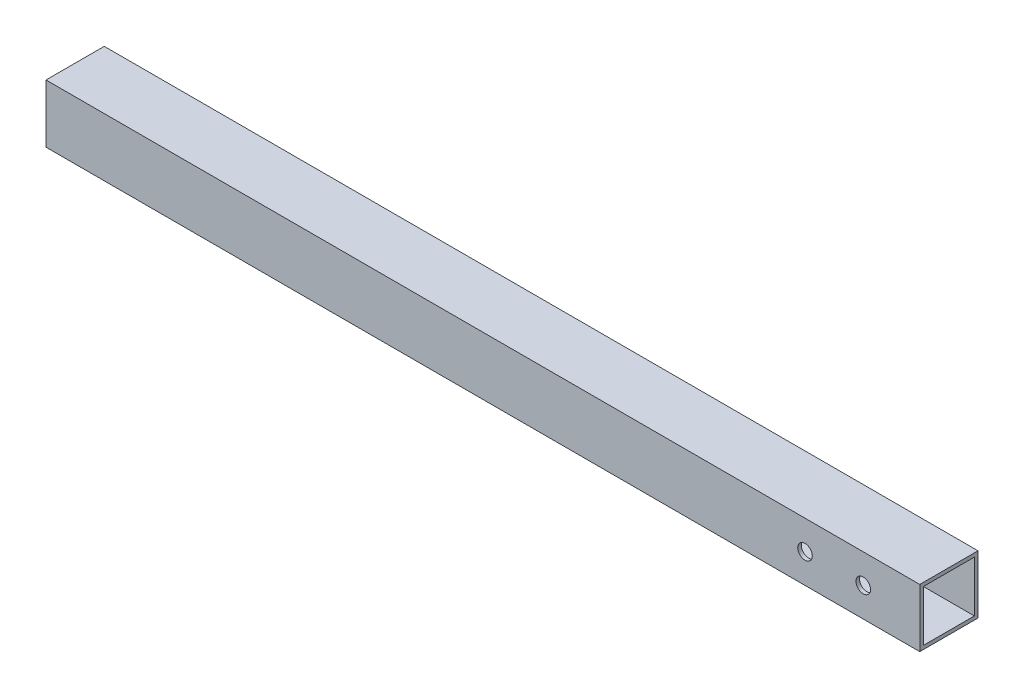
ISO-10303-21;
HEADER;
FILE_DESCRIPTION(('STEP AP214'),'2;1');
FILE_NAME('part.step','',(''),(''),'','','');
FILE_SCHEMA(('AUTOMOTIVE_DESIGN { 1 0 10303 214 1 1 1 1 }'));
ENDSEC;
DATA;
#1=APPLICATION_CONTEXT('core data for automotive mechanical design processes');
#2=APPLICATION_PROTOCOL_DEFINITION('international standard','automotive_design',2000,#1);
#3=PRODUCT_CONTEXT('',#1,'mechanical');
#4=PRODUCT('Part','Part','',(#3));
#5=PRODUCT_RELATED_PRODUCT_CATEGORY('part','',(#4));
#6=PRODUCT_DEFINITION_FORMATION('','',#4);
#7=PRODUCT_DEFINITION_CONTEXT('part definition',#1,'design');
#8=PRODUCT_DEFINITION('design','',#6,#7);
#9=PRODUCT_DEFINITION_SHAPE('','',#8);
#10=(LENGTH_UNIT() NAMED_UNIT(*) SI_UNIT(.MILLI.,.METRE.));
#11=(NAMED_UNIT(*) PLANE_ANGLE_UNIT() SI_UNIT($,.RADIAN.));
#12=(NAMED_UNIT(*) SI_UNIT($,.STERADIAN.) SOLID_ANGLE_UNIT());
#13=UNCERTAINTY_MEASURE_WITH_UNIT(LENGTH_MEASURE(1.E-05),#10,'distance_accuracy_value','');
#14=(GEOMETRIC_REPRESENTATION_CONTEXT(3) GLOBAL_UNCERTAINTY_ASSIGNED_CONTEXT((#13)) GLOBAL_UNIT_ASSIGNED_CONTEXT((#10,
#11,#12)) REPRESENTATION_CONTEXT('',''));
#15=CARTESIAN_POINT('',(0.,0.,0.));
#16=DIRECTION('',(0.,0.,1.));
#17=DIRECTION('',(1.,0.,0.));
#18=AXIS2_PLACEMENT_3D('',#15,#16,#17);
#19=CARTESIAN_POINT('',(381.,0.,0.));
#20=DIRECTION('',(1.,0.,0.));
#21=DIRECTION('',(0.,0.,-1.));
#22=AXIS2_PLACEMENT_3D('',#19,#20,#21);
#23=PLANE('',#22);
#24=DIRECTION('',(0.,1.,0.));
#25=VECTOR('',#24,1.);
#26=CARTESIAN_POINT('',(381.,12.7,-12.7));
#27=LINE('',#26,#25);
#28=CARTESIAN_POINT('',(381.,-12.7,-12.7));
#29=VERTEX_POINT('',#28);
#30=CARTESIAN_POINT('',(381.,12.7,-12.7));
#31=VERTEX_POINT('',#30);
#32=EDGE_CURVE('E139',#29,#31,#27,.T.);
#33=ORIENTED_EDGE('',*,*,#32,.T.);
#34=DIRECTION('',(0.,0.,1.));
#35=VECTOR('',#34,1.);
#36=CARTESIAN_POINT('',(381.,12.7,12.7));
#37=LINE('',#36,#35);
#38=CARTESIAN_POINT('',(381.,12.7,12.7));
#39=VERTEX_POINT('',#38);
#40=EDGE_CURVE('E142',#31,#39,#37,.T.);
#41=ORIENTED_EDGE('',*,*,#40,.T.);
#42=DIRECTION('',(0.,-1.,0.));
#43=VECTOR('',#42,1.);
#44=CARTESIAN_POINT('',(381.,12.7,12.7));
#45=LINE('',#44,#43);
#46=CARTESIAN_POINT('',(381.,-12.7,12.7));
#47=VERTEX_POINT('',#46);
#48=EDGE_CURVE('E145',#39,#47,#45,.T.);
#49=ORIENTED_EDGE('',*,*,#48,.T.);
#50=DIRECTION('',(0.,0.,-1.));
#51=VECTOR('',#50,1.);
#52=CARTESIAN_POINT('',(381.,-12.7,12.7));
#53=LINE('',#52,#51);
#54=EDGE_CURVE('E147',#47,#29,#53,.T.);
#55=ORIENTED_EDGE('',*,*,#54,.T.);
#56=EDGE_LOOP('',(#33,#41,#49,#55));
#57=FACE_BOUND('',#56,.T.);
#58=DIRECTION('',(0.,-1.,0.));
#59=VECTOR('',#58,1.);
#60=CARTESIAN_POINT('',(381.,11.1125,11.1125));
#61=LINE('',#60,#59);
#62=CARTESIAN_POINT('',(381.,11.1125,11.1125));
#63=VERTEX_POINT('',#62);
#64=CARTESIAN_POINT('',(381.,-11.1125,11.1125));
#65=VERTEX_POINT('',#64);
#66=EDGE_CURVE('E109',#63,#65,#61,.T.);
#67=ORIENTED_EDGE('',*,*,#66,.F.);
#68=DIRECTION('',(0.,0.,1.));
#69=VECTOR('',#68,1.);
#70=CARTESIAN_POINT('',(381.,11.1125,11.1125));
#71=LINE('',#70,#69);
#72=CARTESIAN_POINT('',(381.,11.1125,-11.1125));
#73=VERTEX_POINT('',#72);
#74=EDGE_CURVE('E101',#73,#63,#71,.T.);
#75=ORIENTED_EDGE('',*,*,#74,.F.);
#76=DIRECTION('',(0.,1.,0.));
#77=VECTOR('',#76,1.);
#78=CARTESIAN_POINT('',(381.,11.1125,-11.1125));
#79=LINE('',#78,#77);
#80=CARTESIAN_POINT('',(381.,-11.1125,-11.1125));
#81=VERTEX_POINT('',#80);
#82=EDGE_CURVE('E123',#81,#73,#79,.T.);
#83=ORIENTED_EDGE('',*,*,#82,.F.);
#84=DIRECTION('',(0.,0.,-1.));
#85=VECTOR('',#84,1.);
#86=CARTESIAN_POINT('',(381.,-11.1125,11.1125));
#87=LINE('',#86,#85);
#88=EDGE_CURVE('E121',#65,#81,#87,.T.);
#89=ORIENTED_EDGE('',*,*,#88,.F.);
#90=EDGE_LOOP('',(#67,#75,#83,#89));
#91=FACE_BOUND('',#90,.T.);
#92=ADVANCED_FACE('F34',(#57,#91),#23,.T.);
#93=CARTESIAN_POINT('',(0.,0.,0.));
#94=DIRECTION('',(1.,0.,0.));
#95=DIRECTION('',(0.,0.,-1.));
#96=AXIS2_PLACEMENT_3D('',#93,#94,#95);
#97=PLANE('',#96);
#98=DIRECTION('',(0.,1.,0.));
#99=VECTOR('',#98,1.);
#100=CARTESIAN_POINT('',(0.,12.7,-12.7));
#101=LINE('',#100,#99);
#102=CARTESIAN_POINT('',(0.,-12.7,-12.7));
#103=VERTEX_POINT('',#102);
#104=CARTESIAN_POINT('',(0.,12.7,-12.7));
#105=VERTEX_POINT('',#104);
#106=EDGE_CURVE('E117',#103,#105,#101,.T.);
#107=ORIENTED_EDGE('',*,*,#106,.F.);
#108=DIRECTION('',(0.,0.,-1.));
#109=VECTOR('',#108,1.);
#110=CARTESIAN_POINT('',(0.,-12.7,12.7));
#111=LINE('',#110,#109);
#112=CARTESIAN_POINT('',(0.,-12.7,12.7));
#113=VERTEX_POINT('',#112);
#114=EDGE_CURVE('E143',#113,#103,#111,.T.);
#115=ORIENTED_EDGE('',*,*,#114,.F.);
#116=DIRECTION('',(0.,-1.,0.));
#117=VECTOR('',#116,1.);
#118=CARTESIAN_POINT('',(0.,12.7,12.7));
#119=LINE('',#118,#117);
#120=CARTESIAN_POINT('',(0.,12.7,12.7));
#121=VERTEX_POINT('',#120);
#122=EDGE_CURVE('E154',#121,#113,#119,.T.);
#123=ORIENTED_EDGE('',*,*,#122,.F.);
#124=DIRECTION('',(0.,0.,1.));
#125=VECTOR('',#124,1.);
#126=CARTESIAN_POINT('',(0.,12.7,12.7));
#127=LINE('',#126,#125);
#128=EDGE_CURVE('E152',#105,#121,#127,.T.);
#129=ORIENTED_EDGE('',*,*,#128,.F.);
#130=EDGE_LOOP('',(#107,#115,#123,#129));
#131=FACE_BOUND('',#130,.T.);
#132=DIRECTION('',(0.,0.,1.));
#133=VECTOR('',#132,1.);
#134=CARTESIAN_POINT('',(0.,11.1125,11.1125));
#135=LINE('',#134,#133);
#136=CARTESIAN_POINT('',(0.,11.1125,-11.1125));
#137=VERTEX_POINT('',#136);
#138=CARTESIAN_POINT('',(0.,11.1125,11.1125));
#139=VERTEX_POINT('',#138);
#140=EDGE_CURVE('E59',#137,#139,#135,.T.);
#141=ORIENTED_EDGE('',*,*,#140,.T.);
#142=DIRECTION('',(0.,-1.,0.));
#143=VECTOR('',#142,1.);
#144=CARTESIAN_POINT('',(0.,11.1125,11.1125));
#145=LINE('',#144,#143);
#146=CARTESIAN_POINT('',(0.,-11.1125,11.1125));
#147=VERTEX_POINT('',#146);
#148=EDGE_CURVE('E116',#139,#147,#145,.T.);
#149=ORIENTED_EDGE('',*,*,#148,.T.);
#150=DIRECTION('',(0.,0.,-1.));
#151=VECTOR('',#150,1.);
#152=CARTESIAN_POINT('',(0.,-11.1125,11.1125));
#153=LINE('',#152,#151);
#154=CARTESIAN_POINT('',(0.,-11.1125,-11.1125));
#155=VERTEX_POINT('',#154);
#156=EDGE_CURVE('E131',#147,#155,#153,.T.);
#157=ORIENTED_EDGE('',*,*,#156,.T.);
#158=DIRECTION('',(0.,1.,0.));
#159=VECTOR('',#158,1.);
#160=CARTESIAN_POINT('',(0.,11.1125,-11.1125));
#161=LINE('',#160,#159);
#162=EDGE_CURVE('E110',#155,#137,#161,.T.);
#163=ORIENTED_EDGE('',*,*,#162,.T.);
#164=EDGE_LOOP('',(#141,#149,#157,#163));
#165=FACE_BOUND('',#164,.T.);
#166=ADVANCED_FACE('F202',(#131,#165),#97,.F.);
#167=CARTESIAN_POINT('',(381.,12.7,-12.7));
#168=DIRECTION('',(0.,0.,1.));
#169=DIRECTION('',(0.,-1.,0.));
#170=AXIS2_PLACEMENT_3D('',#167,#168,#169);
#171=PLANE('',#170);
#172=CARTESIAN_POINT('',(330.962,0.,-12.7));
#173=DIRECTION('',(0.,0.,-1.));
#174=DIRECTION('',(0.,1.,0.));
#175=AXIS2_PLACEMENT_3D('',#172,#173,#174);
#176=CIRCLE('',#175,3.17499999999997);
#177=CARTESIAN_POINT('',(330.962,3.17499999999997,-12.7));
#178=VERTEX_POINT('',#177);
#179=EDGE_CURVE('E263',#178,#178,#176,.T.);
#180=ORIENTED_EDGE('',*,*,#179,.F.);
#181=EDGE_LOOP('',(#180));
#182=FACE_BOUND('',#181,.T.);
#183=CARTESIAN_POINT('',(356.362,0.,-12.7));
#184=DIRECTION('',(0.,0.,-1.));
#185=DIRECTION('',(0.,1.,0.));
#186=AXIS2_PLACEMENT_3D('',#183,#184,#185);
#187=CIRCLE('',#186,3.17499999999997);
#188=CARTESIAN_POINT('',(356.362,3.17499999999997,-12.7));
#189=VERTEX_POINT('',#188);
#190=EDGE_CURVE('E166',#189,#189,#187,.T.);
#191=ORIENTED_EDGE('',*,*,#190,.F.);
#192=EDGE_LOOP('',(#191));
#193=FACE_BOUND('',#192,.T.);
#194=ORIENTED_EDGE('',*,*,#106,.T.);
#195=DIRECTION('',(-1.,0.,0.));
#196=VECTOR('',#195,1.);
#197=CARTESIAN_POINT('',(381.,12.7,-12.7));
#198=LINE('',#197,#196);
#199=EDGE_CURVE('E11',#31,#105,#198,.T.);
#200=ORIENTED_EDGE('',*,*,#199,.F.);
#201=ORIENTED_EDGE('',*,*,#32,.F.);
#202=DIRECTION('',(-1.,0.,0.));
#203=VECTOR('',#202,1.);
#204=CARTESIAN_POINT('',(381.,-12.7,-12.7));
#205=LINE('',#204,#203);
#206=EDGE_CURVE('E149',#29,#103,#205,.T.);
#207=ORIENTED_EDGE('',*,*,#206,.T.);
#208=EDGE_LOOP('',(#194,#200,#201,#207));
#209=FACE_BOUND('',#208,.T.);
#210=ADVANCED_FACE('F36',(#182,#193,#209),#171,.F.);
#211=CARTESIAN_POINT('',(381.,12.7,12.7));
#212=DIRECTION('',(0.,-1.,0.));
#213=DIRECTION('',(0.,0.,-1.));
#214=AXIS2_PLACEMENT_3D('',#211,#212,#213);
#215=PLANE('',#214);
#216=ORIENTED_EDGE('',*,*,#128,.T.);
#217=DIRECTION('',(-1.,0.,0.));
#218=VECTOR('',#217,1.);
#219=CARTESIAN_POINT('',(381.,12.7,12.7));
#220=LINE('',#219,#218);
#221=EDGE_CURVE('E43',#39,#121,#220,.T.);
#222=ORIENTED_EDGE('',*,*,#221,.F.);
#223=ORIENTED_EDGE('',*,*,#40,.F.);
#224=ORIENTED_EDGE('',*,*,#199,.T.);
#225=EDGE_LOOP('',(#216,#222,#223,#224));
#226=FACE_BOUND('',#225,.T.);
#227=ADVANCED_FACE('F218',(#226),#215,.F.);
#228=CARTESIAN_POINT('',(381.,12.7,12.7));
#229=DIRECTION('',(0.,0.,-1.));
#230=DIRECTION('',(0.,1.,0.));
#231=AXIS2_PLACEMENT_3D('',#228,#229,#230);
#232=PLANE('',#231);
#233=CARTESIAN_POINT('',(330.962,0.,12.7));
#234=DIRECTION('',(0.,0.,-1.));
#235=DIRECTION('',(0.,1.,0.));
#236=AXIS2_PLACEMENT_3D('',#233,#234,#235);
#237=CIRCLE('',#236,3.17499999999997);
#238=CARTESIAN_POINT('',(330.962,3.17499999999997,12.7));
#239=VERTEX_POINT('',#238);
#240=EDGE_CURVE('E172',#239,#239,#237,.T.);
#241=ORIENTED_EDGE('',*,*,#240,.T.);
#242=EDGE_LOOP('',(#241));
#243=FACE_BOUND('',#242,.T.);
#244=CARTESIAN_POINT('',(356.362,0.,12.7));
#245=DIRECTION('',(0.,0.,-1.));
#246=DIRECTION('',(0.,1.,0.));
#247=AXIS2_PLACEMENT_3D('',#244,#245,#246);
#248=CIRCLE('',#247,3.17499999999997);
#249=CARTESIAN_POINT('',(356.362,3.17499999999997,12.7));
#250=VERTEX_POINT('',#249);
#251=EDGE_CURVE('E129',#250,#250,#248,.T.);
#252=ORIENTED_EDGE('',*,*,#251,.T.);
#253=EDGE_LOOP('',(#252));
#254=FACE_BOUND('',#253,.T.);
#255=ORIENTED_EDGE('',*,*,#122,.T.);
#256=DIRECTION('',(-1.,0.,0.));
#257=VECTOR('',#256,1.);
#258=CARTESIAN_POINT('',(381.,-12.7,12.7));
#259=LINE('',#258,#257);
#260=EDGE_CURVE('E159',#47,#113,#259,.T.);
#261=ORIENTED_EDGE('',*,*,#260,.F.);
#262=ORIENTED_EDGE('',*,*,#48,.F.);
#263=ORIENTED_EDGE('',*,*,#221,.T.);
#264=EDGE_LOOP('',(#255,#261,#262,#263));
#265=FACE_BOUND('',#264,.T.);
#266=ADVANCED_FACE('F183',(#243,#254,#265),#232,.F.);
#267=CARTESIAN_POINT('',(381.,-12.7,12.7));
#268=DIRECTION('',(0.,1.,0.));
#269=DIRECTION('',(0.,0.,1.));
#270=AXIS2_PLACEMENT_3D('',#267,#268,#269);
#271=PLANE('',#270);
#272=ORIENTED_EDGE('',*,*,#114,.T.);
#273=ORIENTED_EDGE('',*,*,#206,.F.);
#274=ORIENTED_EDGE('',*,*,#54,.F.);
#275=ORIENTED_EDGE('',*,*,#260,.T.);
#276=EDGE_LOOP('',(#272,#273,#274,#275));
#277=FACE_BOUND('',#276,.T.);
#278=ADVANCED_FACE('F213',(#277),#271,.F.);
#279=CARTESIAN_POINT('',(381.,11.1125,11.1125));
#280=DIRECTION('',(0.,-1.,0.));
#281=DIRECTION('',(0.,0.,-1.));
#282=AXIS2_PLACEMENT_3D('',#279,#280,#281);
#283=PLANE('',#282);
#284=ORIENTED_EDGE('',*,*,#140,.F.);
#285=DIRECTION('',(-1.,0.,0.));
#286=VECTOR('',#285,1.);
#287=CARTESIAN_POINT('',(381.,11.1125,-11.1125));
#288=LINE('',#287,#286);
#289=EDGE_CURVE('E105',#73,#137,#288,.T.);
#290=ORIENTED_EDGE('',*,*,#289,.F.);
#291=ORIENTED_EDGE('',*,*,#74,.T.);
#292=DIRECTION('',(-1.,0.,0.));
#293=VECTOR('',#292,1.);
#294=CARTESIAN_POINT('',(381.,11.1125,11.1125));
#295=LINE('',#294,#293);
#296=EDGE_CURVE('E104',#63,#139,#295,.T.);
#297=ORIENTED_EDGE('',*,*,#296,.T.);
#298=EDGE_LOOP('',(#284,#290,#291,#297));
#299=FACE_BOUND('',#298,.T.);
#300=ADVANCED_FACE('F103',(#299),#283,.T.);
#301=CARTESIAN_POINT('',(381.,11.1125,11.1125));
#302=DIRECTION('',(0.,0.,-1.));
#303=DIRECTION('',(0.,1.,0.));
#304=AXIS2_PLACEMENT_3D('',#301,#302,#303);
#305=PLANE('',#304);
#306=CARTESIAN_POINT('',(330.962,0.,11.1125));
#307=DIRECTION('',(0.,0.,-1.));
#308=DIRECTION('',(0.,1.,0.));
#309=AXIS2_PLACEMENT_3D('',#306,#307,#308);
#310=CIRCLE('',#309,3.17499999999997);
#311=CARTESIAN_POINT('',(330.962,3.17499999999997,11.1125));
#312=VERTEX_POINT('',#311);
#313=EDGE_CURVE('E177',#312,#312,#310,.T.);
#314=ORIENTED_EDGE('',*,*,#313,.F.);
#315=EDGE_LOOP('',(#314));
#316=FACE_BOUND('',#315,.T.);
#317=CARTESIAN_POINT('',(356.362,0.,11.1125));
#318=DIRECTION('',(0.,0.,-1.));
#319=DIRECTION('',(0.,1.,0.));
#320=AXIS2_PLACEMENT_3D('',#317,#318,#319);
#321=CIRCLE('',#320,3.17499999999997);
#322=CARTESIAN_POINT('',(356.362,3.17499999999997,11.1125));
#323=VERTEX_POINT('',#322);
#324=EDGE_CURVE('E165',#323,#323,#321,.T.);
#325=ORIENTED_EDGE('',*,*,#324,.F.);
#326=EDGE_LOOP('',(#325));
#327=FACE_BOUND('',#326,.T.);
#328=ORIENTED_EDGE('',*,*,#148,.F.);
#329=ORIENTED_EDGE('',*,*,#296,.F.);
#330=ORIENTED_EDGE('',*,*,#66,.T.);
#331=DIRECTION('',(-1.,0.,0.));
#332=VECTOR('',#331,1.);
#333=CARTESIAN_POINT('',(381.,-11.1125,11.1125));
#334=LINE('',#333,#332);
#335=EDGE_CURVE('E118',#65,#147,#334,.T.);
#336=ORIENTED_EDGE('',*,*,#335,.T.);
#337=EDGE_LOOP('',(#328,#329,#330,#336));
#338=FACE_BOUND('',#337,.T.);
#339=ADVANCED_FACE('F113',(#316,#327,#338),#305,.T.);
#340=CARTESIAN_POINT('',(381.,-11.1125,11.1125));
#341=DIRECTION('',(0.,1.,0.));
#342=DIRECTION('',(0.,0.,1.));
#343=AXIS2_PLACEMENT_3D('',#340,#341,#342);
#344=PLANE('',#343);
#345=ORIENTED_EDGE('',*,*,#156,.F.);
#346=ORIENTED_EDGE('',*,*,#335,.F.);
#347=ORIENTED_EDGE('',*,*,#88,.T.);
#348=DIRECTION('',(-1.,0.,0.));
#349=VECTOR('',#348,1.);
#350=CARTESIAN_POINT('',(381.,-11.1125,-11.1125));
#351=LINE('',#350,#349);
#352=EDGE_CURVE('E51',#81,#155,#351,.T.);
#353=ORIENTED_EDGE('',*,*,#352,.T.);
#354=EDGE_LOOP('',(#345,#346,#347,#353));
#355=FACE_BOUND('',#354,.T.);
#356=ADVANCED_FACE('F242',(#355),#344,.T.);
#357=CARTESIAN_POINT('',(381.,11.1125,-11.1125));
#358=DIRECTION('',(0.,0.,1.));
#359=DIRECTION('',(0.,-1.,0.));
#360=AXIS2_PLACEMENT_3D('',#357,#358,#359);
#361=PLANE('',#360);
#362=CARTESIAN_POINT('',(330.962,0.,-11.1125));
#363=DIRECTION('',(0.,0.,1.));
#364=DIRECTION('',(0.,-1.,0.));
#365=AXIS2_PLACEMENT_3D('',#362,#363,#364);
#366=CIRCLE('',#365,3.17499999999997);
#367=CARTESIAN_POINT('',(330.962,-3.17499999999997,-11.1125));
#368=VERTEX_POINT('',#367);
#369=EDGE_CURVE('E38',#368,#368,#366,.T.);
#370=ORIENTED_EDGE('',*,*,#369,.F.);
#371=EDGE_LOOP('',(#370));
#372=FACE_BOUND('',#371,.T.);
#373=CARTESIAN_POINT('',(356.362,0.,-11.1125));
#374=DIRECTION('',(0.,0.,1.));
#375=DIRECTION('',(0.,-1.,0.));
#376=AXIS2_PLACEMENT_3D('',#373,#374,#375);
#377=CIRCLE('',#376,3.17499999999997);
#378=CARTESIAN_POINT('',(356.362,-3.17499999999997,-11.1125));
#379=VERTEX_POINT('',#378);
#380=EDGE_CURVE('E163',#379,#379,#377,.T.);
#381=ORIENTED_EDGE('',*,*,#380,.F.);
#382=EDGE_LOOP('',(#381));
#383=FACE_BOUND('',#382,.T.);
#384=ORIENTED_EDGE('',*,*,#162,.F.);
#385=ORIENTED_EDGE('',*,*,#352,.F.);
#386=ORIENTED_EDGE('',*,*,#82,.T.);
#387=ORIENTED_EDGE('',*,*,#289,.T.);
#388=EDGE_LOOP('',(#384,#385,#386,#387));
#389=FACE_BOUND('',#388,.T.);
#390=ADVANCED_FACE('F199',(#372,#383,#389),#361,.T.);
#391=CARTESIAN_POINT('',(356.362,0.,368.3));
#392=DIRECTION('',(0.,0.,-1.));
#393=DIRECTION('',(0.,1.,0.));
#394=AXIS2_PLACEMENT_3D('',#391,#392,#393);
#395=CYLINDRICAL_SURFACE('',#394,3.17499999999997);
#396=ORIENTED_EDGE('',*,*,#380,.T.);
#397=EDGE_LOOP('',(#396));
#398=FACE_BOUND('',#397,.T.);
#399=ORIENTED_EDGE('',*,*,#190,.T.);
#400=EDGE_LOOP('',(#399));
#401=FACE_BOUND('',#400,.T.);
#402=ADVANCED_FACE('F189',(#398,#401),#395,.F.);
#403=ORIENTED_EDGE('',*,*,#324,.T.);
#404=EDGE_LOOP('',(#403));
#405=FACE_BOUND('',#404,.T.);
#406=ORIENTED_EDGE('',*,*,#251,.F.);
#407=EDGE_LOOP('',(#406));
#408=FACE_BOUND('',#407,.T.);
#409=ADVANCED_FACE('F186',(#405,#408),#395,.F.);
#410=CARTESIAN_POINT('',(330.962,0.,368.3));
#411=DIRECTION('',(0.,0.,-1.));
#412=DIRECTION('',(0.,1.,0.));
#413=AXIS2_PLACEMENT_3D('',#410,#411,#412);
#414=CYLINDRICAL_SURFACE('',#413,3.17499999999997);
#415=ORIENTED_EDGE('',*,*,#369,.T.);
#416=EDGE_LOOP('',(#415));
#417=FACE_BOUND('',#416,.T.);
#418=ORIENTED_EDGE('',*,*,#179,.T.);
#419=EDGE_LOOP('',(#418));
#420=FACE_BOUND('',#419,.T.);
#421=ADVANCED_FACE('F188',(#417,#420),#414,.F.);
#422=ORIENTED_EDGE('',*,*,#313,.T.);
#423=EDGE_LOOP('',(#422));
#424=FACE_BOUND('',#423,.T.);
#425=ORIENTED_EDGE('',*,*,#240,.F.);
#426=EDGE_LOOP('',(#425));
#427=FACE_BOUND('',#426,.T.);
#428=ADVANCED_FACE('F196',(#424,#427),#414,.F.);
#429=CLOSED_SHELL('',(#92,#166,#210,#227,#266,#278,#300,#339,#356,#390,#402,#409,#421,#428));
#430=MANIFOLD_SOLID_BREP('B2',#429);
#431=ADVANCED_BREP_SHAPE_REPRESENTATION('',(#18,#430),#14);
#432=SHAPE_DEFINITION_REPRESENTATION(#9,#431);
ENDSEC;
END-ISO-10303-21;
